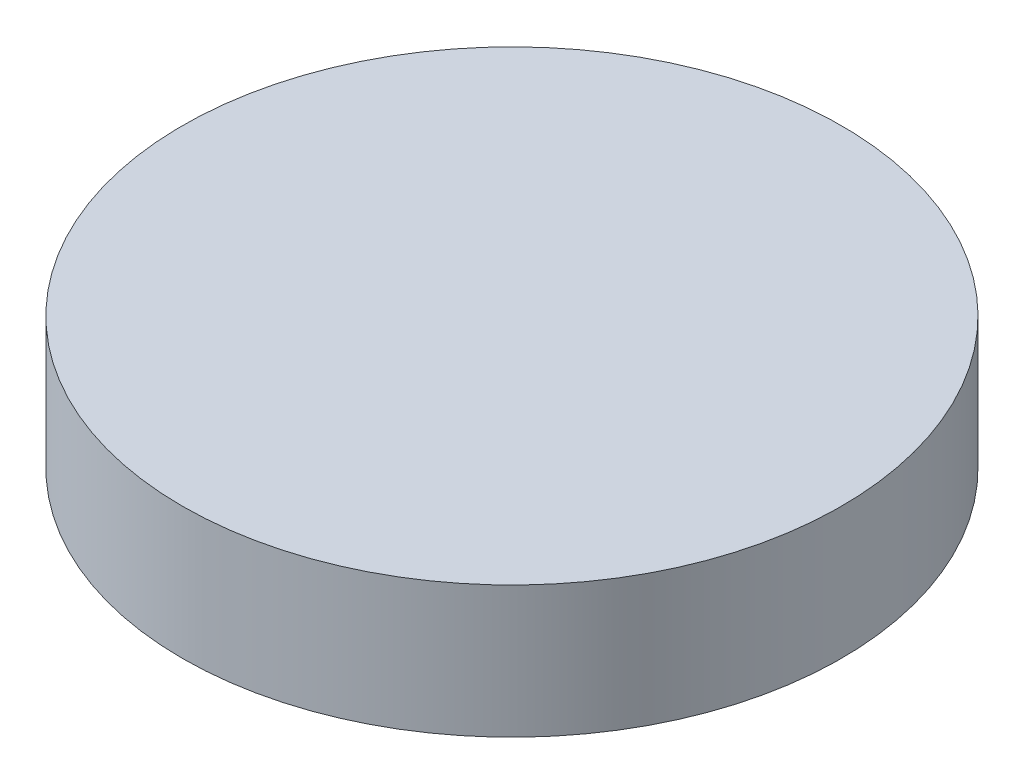
ISO-10303-21;
HEADER;
FILE_DESCRIPTION(('STEP AP214'),'2;1');
FILE_NAME('part.step','',(''),(''),'','','');
FILE_SCHEMA(('AUTOMOTIVE_DESIGN { 1 0 10303 214 1 1 1 1 }'));
ENDSEC;
DATA;
#1=APPLICATION_CONTEXT('core data for automotive mechanical design processes');
#2=APPLICATION_PROTOCOL_DEFINITION('international standard','automotive_design',2000,#1);
#3=PRODUCT_CONTEXT('',#1,'mechanical');
#4=PRODUCT('Part','Part','',(#3));
#5=PRODUCT_RELATED_PRODUCT_CATEGORY('part','',(#4));
#6=PRODUCT_DEFINITION_FORMATION('','',#4);
#7=PRODUCT_DEFINITION_CONTEXT('part definition',#1,'design');
#8=PRODUCT_DEFINITION('design','',#6,#7);
#9=PRODUCT_DEFINITION_SHAPE('','',#8);
#10=(LENGTH_UNIT() NAMED_UNIT(*) SI_UNIT(.MILLI.,.METRE.));
#11=(NAMED_UNIT(*) PLANE_ANGLE_UNIT() SI_UNIT($,.RADIAN.));
#12=(NAMED_UNIT(*) SI_UNIT($,.STERADIAN.) SOLID_ANGLE_UNIT());
#13=UNCERTAINTY_MEASURE_WITH_UNIT(LENGTH_MEASURE(1.E-05),#10,'distance_accuracy_value','');
#14=(GEOMETRIC_REPRESENTATION_CONTEXT(3) GLOBAL_UNCERTAINTY_ASSIGNED_CONTEXT((#13)) GLOBAL_UNIT_ASSIGNED_CONTEXT((#10,
#11,#12)) REPRESENTATION_CONTEXT('',''));
#15=CARTESIAN_POINT('',(0.,0.,0.));
#16=DIRECTION('',(0.,0.,1.));
#17=DIRECTION('',(1.,0.,0.));
#18=AXIS2_PLACEMENT_3D('',#15,#16,#17);
#19=CARTESIAN_POINT('',(0.,50.8,0.));
#20=DIRECTION('',(0.,-1.,0.));
#21=DIRECTION('',(0.,0.,-1.));
#22=AXIS2_PLACEMENT_3D('',#19,#20,#21);
#23=CYLINDRICAL_SURFACE('',#22,127.);
#24=CARTESIAN_POINT('',(0.,50.8,0.));
#25=DIRECTION('',(0.,1.,0.));
#26=DIRECTION('',(0.,0.,1.));
#27=AXIS2_PLACEMENT_3D('',#24,#25,#26);
#28=CIRCLE('',#27,127.);
#29=CARTESIAN_POINT('',(0.,50.8,127.));
#30=VERTEX_POINT('',#29);
#31=EDGE_CURVE('E10',#30,#30,#28,.T.);
#32=ORIENTED_EDGE('',*,*,#31,.F.);
#33=EDGE_LOOP('',(#32));
#34=FACE_BOUND('',#33,.T.);
#35=CARTESIAN_POINT('',(0.,0.,0.));
#36=DIRECTION('',(0.,1.,0.));
#37=DIRECTION('',(0.,0.,1.));
#38=AXIS2_PLACEMENT_3D('',#35,#36,#37);
#39=CIRCLE('',#38,127.);
#40=CARTESIAN_POINT('',(0.,0.,127.));
#41=VERTEX_POINT('',#40);
#42=EDGE_CURVE('E34',#41,#41,#39,.T.);
#43=ORIENTED_EDGE('',*,*,#42,.T.);
#44=EDGE_LOOP('',(#43));
#45=FACE_BOUND('',#44,.T.);
#46=ADVANCED_FACE('F31',(#34,#45),#23,.T.);
#47=CARTESIAN_POINT('',(0.,50.8,0.));
#48=DIRECTION('',(0.,1.,0.));
#49=DIRECTION('',(0.,0.,1.));
#50=AXIS2_PLACEMENT_3D('',#47,#48,#49);
#51=PLANE('',#50);
#52=ORIENTED_EDGE('',*,*,#31,.T.);
#53=EDGE_LOOP('',(#52));
#54=FACE_BOUND('',#53,.T.);
#55=ADVANCED_FACE('F46',(#54),#51,.T.);
#56=CARTESIAN_POINT('',(0.,0.,0.));
#57=DIRECTION('',(0.,1.,0.));
#58=DIRECTION('',(0.,0.,1.));
#59=AXIS2_PLACEMENT_3D('',#56,#57,#58);
#60=PLANE('',#59);
#61=ORIENTED_EDGE('',*,*,#42,.F.);
#62=EDGE_LOOP('',(#61));
#63=FACE_BOUND('',#62,.T.);
#64=ADVANCED_FACE('F44',(#63),#60,.F.);
#65=CLOSED_SHELL('',(#46,#55,#64));
#66=MANIFOLD_SOLID_BREP('B2',#65);
#67=ADVANCED_BREP_SHAPE_REPRESENTATION('',(#18,#66),#14);
#68=SHAPE_DEFINITION_REPRESENTATION(#9,#67);
ENDSEC;
END-ISO-10303-21;
